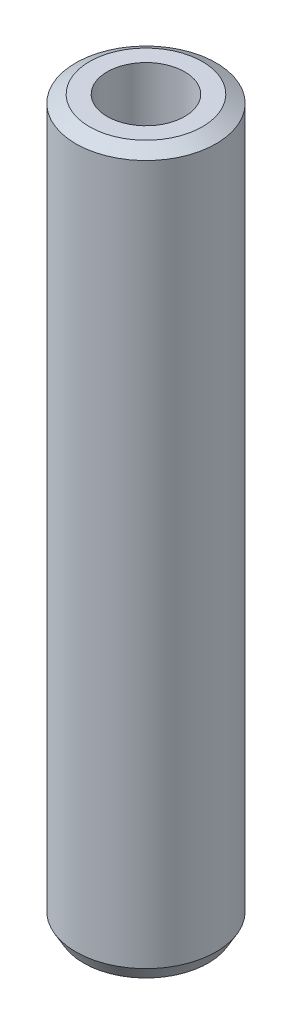
ISO-10303-21;
HEADER;
FILE_DESCRIPTION(('STEP AP214'),'2;1');
FILE_NAME('part.step','',(''),(''),'','','');
FILE_SCHEMA(('AUTOMOTIVE_DESIGN { 1 0 10303 214 1 1 1 1 }'));
ENDSEC;
DATA;
#1=APPLICATION_CONTEXT('core data for automotive mechanical design processes');
#2=APPLICATION_PROTOCOL_DEFINITION('international standard','automotive_design',2000,#1);
#3=PRODUCT_CONTEXT('',#1,'mechanical');
#4=PRODUCT('Part','Part','',(#3));
#5=PRODUCT_RELATED_PRODUCT_CATEGORY('part','',(#4));
#6=PRODUCT_DEFINITION_FORMATION('','',#4);
#7=PRODUCT_DEFINITION_CONTEXT('part definition',#1,'design');
#8=PRODUCT_DEFINITION('design','',#6,#7);
#9=PRODUCT_DEFINITION_SHAPE('','',#8);
#10=(LENGTH_UNIT() NAMED_UNIT(*) SI_UNIT(.MILLI.,.METRE.));
#11=(NAMED_UNIT(*) PLANE_ANGLE_UNIT() SI_UNIT($,.RADIAN.));
#12=(NAMED_UNIT(*) SI_UNIT($,.STERADIAN.) SOLID_ANGLE_UNIT());
#13=UNCERTAINTY_MEASURE_WITH_UNIT(LENGTH_MEASURE(1.E-05),#10,'distance_accuracy_value','');
#14=(GEOMETRIC_REPRESENTATION_CONTEXT(3) GLOBAL_UNCERTAINTY_ASSIGNED_CONTEXT((#13)) GLOBAL_UNIT_ASSIGNED_CONTEXT((#10,
#11,#12)) REPRESENTATION_CONTEXT('',''));
#15=CARTESIAN_POINT('',(0.,0.,0.));
#16=DIRECTION('',(0.,0.,1.));
#17=DIRECTION('',(1.,0.,0.));
#18=AXIS2_PLACEMENT_3D('',#15,#16,#17);
#19=CARTESIAN_POINT('',(0.,77.1191186838768,0.));
#20=DIRECTION('',(0.,-1.,0.));
#21=DIRECTION('',(0.,0.,-1.));
#22=AXIS2_PLACEMENT_3D('',#19,#20,#21);
#23=CYLINDRICAL_SURFACE('',#22,7.5);
#24=CARTESIAN_POINT('',(0.,76.2744112822426,0.));
#25=DIRECTION('',(0.,1.,0.));
#26=DIRECTION('',(0.,0.,1.));
#27=AXIS2_PLACEMENT_3D('',#24,#25,#26);
#28=CIRCLE('',#27,7.5);
#29=CARTESIAN_POINT('',(0.,76.2744112822426,7.5));
#30=VERTEX_POINT('',#29);
#31=EDGE_CURVE('E50',#30,#30,#28,.F.);
#32=ORIENTED_EDGE('',*,*,#31,.T.);
#33=EDGE_LOOP('',(#32));
#34=FACE_BOUND('',#33,.T.);
#35=CARTESIAN_POINT('',(0.,1.46307613715993,0.));
#36=DIRECTION('',(0.,1.,0.));
#37=DIRECTION('',(0.,0.,1.));
#38=AXIS2_PLACEMENT_3D('',#35,#36,#37);
#39=CIRCLE('',#38,7.5);
#40=CARTESIAN_POINT('',(0.,1.46307613715993,7.5));
#41=VERTEX_POINT('',#40);
#42=EDGE_CURVE('E51',#41,#41,#39,.T.);
#43=ORIENTED_EDGE('',*,*,#42,.T.);
#44=EDGE_LOOP('',(#43));
#45=FACE_BOUND('',#44,.T.);
#46=ADVANCED_FACE('F39',(#34,#45),#23,.T.);
#47=CARTESIAN_POINT('',(0.,77.1191186838768,0.));
#48=DIRECTION('',(0.,1.,0.));
#49=DIRECTION('',(0.,0.,1.));
#50=AXIS2_PLACEMENT_3D('',#47,#48,#49);
#51=PLANE('',#50);
#52=CARTESIAN_POINT('',(0.,77.1191186838768,0.));
#53=DIRECTION('',(0.,1.,0.));
#54=DIRECTION('',(0.,0.,1.));
#55=AXIS2_PLACEMENT_3D('',#52,#53,#54);
#56=CIRCLE('',#55,6.03692386284005);
#57=CARTESIAN_POINT('',(0.,77.1191186838768,6.03692386284005));
#58=VERTEX_POINT('',#57);
#59=EDGE_CURVE('E54',#58,#58,#56,.T.);
#60=ORIENTED_EDGE('',*,*,#59,.T.);
#61=EDGE_LOOP('',(#60));
#62=FACE_BOUND('',#61,.T.);
#63=CARTESIAN_POINT('',(0.,77.1191186838768,0.));
#64=DIRECTION('',(0.,1.,0.));
#65=DIRECTION('',(0.,0.,1.));
#66=AXIS2_PLACEMENT_3D('',#63,#64,#65);
#67=CIRCLE('',#66,4.14260607204478);
#68=CARTESIAN_POINT('',(0.,77.1191186838768,4.14260607204478));
#69=VERTEX_POINT('',#68);
#70=EDGE_CURVE('E58',#69,#69,#67,.T.);
#71=ORIENTED_EDGE('',*,*,#70,.F.);
#72=EDGE_LOOP('',(#71));
#73=FACE_BOUND('',#72,.T.);
#74=ADVANCED_FACE('F69',(#62,#73),#51,.T.);
#75=CARTESIAN_POINT('',(0.,0.,0.));
#76=DIRECTION('',(0.,1.,0.));
#77=DIRECTION('',(0.,0.,1.));
#78=AXIS2_PLACEMENT_3D('',#75,#76,#77);
#79=PLANE('',#78);
#80=CARTESIAN_POINT('',(0.,0.,0.));
#81=DIRECTION('',(0.,1.,0.));
#82=DIRECTION('',(0.,0.,1.));
#83=AXIS2_PLACEMENT_3D('',#80,#81,#82);
#84=CIRCLE('',#83,6.65529259836579);
#85=CARTESIAN_POINT('',(0.,0.,6.65529259836579));
#86=VERTEX_POINT('',#85);
#87=EDGE_CURVE('E10',#86,#86,#84,.F.);
#88=ORIENTED_EDGE('',*,*,#87,.T.);
#89=EDGE_LOOP('',(#88));
#90=FACE_BOUND('',#89,.T.);
#91=CARTESIAN_POINT('',(0.,0.,0.));
#92=DIRECTION('',(0.,1.,0.));
#93=DIRECTION('',(0.,0.,1.));
#94=AXIS2_PLACEMENT_3D('',#91,#92,#93);
#95=CIRCLE('',#94,4.14260607204478);
#96=CARTESIAN_POINT('',(0.,0.,4.14260607204478));
#97=VERTEX_POINT('',#96);
#98=EDGE_CURVE('E63',#97,#97,#95,.T.);
#99=ORIENTED_EDGE('',*,*,#98,.T.);
#100=EDGE_LOOP('',(#99));
#101=FACE_BOUND('',#100,.T.);
#102=ADVANCED_FACE('F75',(#90,#101),#79,.F.);
#103=CARTESIAN_POINT('',(0.,77.1191186838768,0.));
#104=DIRECTION('',(0.,-1.,0.));
#105=DIRECTION('',(0.,0.,-1.));
#106=AXIS2_PLACEMENT_3D('',#103,#104,#105);
#107=CYLINDRICAL_SURFACE('',#106,4.14260607204478);
#108=ORIENTED_EDGE('',*,*,#70,.T.);
#109=EDGE_LOOP('',(#108));
#110=FACE_BOUND('',#109,.T.);
#111=ORIENTED_EDGE('',*,*,#98,.F.);
#112=EDGE_LOOP('',(#111));
#113=FACE_BOUND('',#112,.T.);
#114=ADVANCED_FACE('F70',(#110,#113),#107,.F.);
#115=CARTESIAN_POINT('',(0.,77.1191186838768,0.));
#116=DIRECTION('',(0.,-1.,0.));
#117=DIRECTION('',(0.,0.,-1.));
#118=AXIS2_PLACEMENT_3D('',#115,#116,#117);
#119=CONICAL_SURFACE('',#118,6.03692386284005,1.04719755119659);
#120=ORIENTED_EDGE('',*,*,#31,.F.);
#121=EDGE_LOOP('',(#120));
#122=FACE_BOUND('',#121,.T.);
#123=ORIENTED_EDGE('',*,*,#59,.F.);
#124=EDGE_LOOP('',(#123));
#125=FACE_BOUND('',#124,.T.);
#126=ADVANCED_FACE('F81',(#122,#125),#119,.T.);
#127=CARTESIAN_POINT('',(0.,1.46307613715993,0.));
#128=DIRECTION('',(0.,1.,0.));
#129=DIRECTION('',(0.,0.,1.));
#130=AXIS2_PLACEMENT_3D('',#127,#128,#129);
#131=CONICAL_SURFACE('',#130,7.5,0.523598775598303);
#132=ORIENTED_EDGE('',*,*,#87,.F.);
#133=EDGE_LOOP('',(#132));
#134=FACE_BOUND('',#133,.T.);
#135=ORIENTED_EDGE('',*,*,#42,.F.);
#136=EDGE_LOOP('',(#135));
#137=FACE_BOUND('',#136,.T.);
#138=ADVANCED_FACE('F45',(#134,#137),#131,.T.);
#139=CLOSED_SHELL('',(#46,#74,#102,#114,#126,#138));
#140=MANIFOLD_SOLID_BREP('B2',#139);
#141=ADVANCED_BREP_SHAPE_REPRESENTATION('',(#18,#140),#14);
#142=SHAPE_DEFINITION_REPRESENTATION(#9,#141);
ENDSEC;
END-ISO-10303-21;
